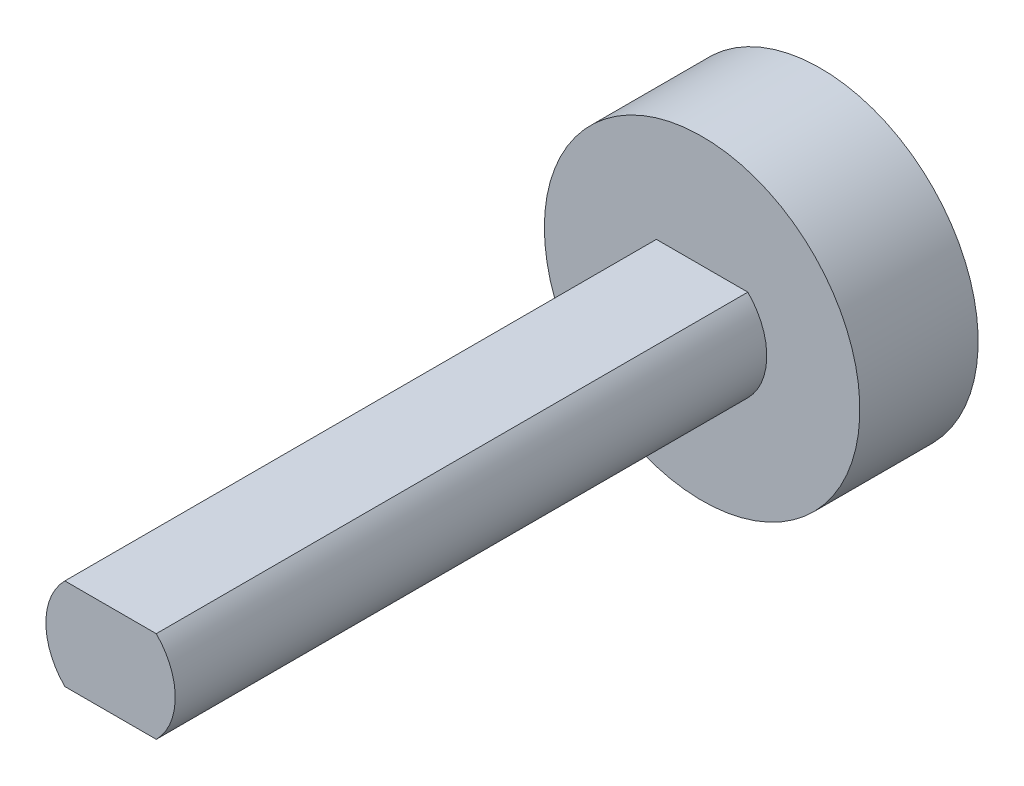
ISO-10303-21;
HEADER;
FILE_DESCRIPTION(('STEP AP214'),'2;1');
FILE_NAME('part.step','',(''),(''),'','','');
FILE_SCHEMA(('AUTOMOTIVE_DESIGN { 1 0 10303 214 1 1 1 1 }'));
ENDSEC;
DATA;
#1=APPLICATION_CONTEXT('core data for automotive mechanical design processes');
#2=APPLICATION_PROTOCOL_DEFINITION('international standard','automotive_design',2000,#1);
#3=PRODUCT_CONTEXT('',#1,'mechanical');
#4=PRODUCT('Part','Part','',(#3));
#5=PRODUCT_RELATED_PRODUCT_CATEGORY('part','',(#4));
#6=PRODUCT_DEFINITION_FORMATION('','',#4);
#7=PRODUCT_DEFINITION_CONTEXT('part definition',#1,'design');
#8=PRODUCT_DEFINITION('design','',#6,#7);
#9=PRODUCT_DEFINITION_SHAPE('','',#8);
#10=(LENGTH_UNIT() NAMED_UNIT(*) SI_UNIT(.MILLI.,.METRE.));
#11=(NAMED_UNIT(*) PLANE_ANGLE_UNIT() SI_UNIT($,.RADIAN.));
#12=(NAMED_UNIT(*) SI_UNIT($,.STERADIAN.) SOLID_ANGLE_UNIT());
#13=UNCERTAINTY_MEASURE_WITH_UNIT(LENGTH_MEASURE(1.E-05),#10,'distance_accuracy_value','');
#14=(GEOMETRIC_REPRESENTATION_CONTEXT(3) GLOBAL_UNCERTAINTY_ASSIGNED_CONTEXT((#13)) GLOBAL_UNIT_ASSIGNED_CONTEXT((#10,
#11,#12)) REPRESENTATION_CONTEXT('',''));
#15=CARTESIAN_POINT('',(0.,0.,0.));
#16=DIRECTION('',(0.,0.,1.));
#17=DIRECTION('',(1.,0.,0.));
#18=AXIS2_PLACEMENT_3D('',#15,#16,#17);
#19=CARTESIAN_POINT('',(0.,0.,114.3));
#20=DIRECTION('',(0.,0.,-1.));
#21=DIRECTION('',(-1.,0.,0.));
#22=AXIS2_PLACEMENT_3D('',#19,#20,#21);
#23=CYLINDRICAL_SURFACE('',#22,10.414);
#24=CARTESIAN_POINT('',(0.,0.,19.05));
#25=DIRECTION('',(0.,0.,-1.));
#26=DIRECTION('',(-1.,0.,0.));
#27=AXIS2_PLACEMENT_3D('',#24,#25,#26);
#28=CIRCLE('',#27,10.414);
#29=CARTESIAN_POINT('',(7.3594523828656,7.36816507852083,19.05));
#30=VERTEX_POINT('',#29);
#31=CARTESIAN_POINT('',(7.3594523828656,-7.36816507852083,19.05));
#32=VERTEX_POINT('',#31);
#33=EDGE_CURVE('E54',#30,#32,#28,.T.);
#34=ORIENTED_EDGE('',*,*,#33,.F.);
#35=DIRECTION('',(0.,0.,-1.));
#36=VECTOR('',#35,1.);
#37=CARTESIAN_POINT('',(7.3594523828656,7.36816507852083,114.3));
#38=LINE('',#37,#36);
#39=CARTESIAN_POINT('',(7.3594523828656,7.36816507852083,114.3));
#40=VERTEX_POINT('',#39);
#41=EDGE_CURVE('E47',#40,#30,#38,.T.);
#42=ORIENTED_EDGE('',*,*,#41,.F.);
#43=CARTESIAN_POINT('',(0.,0.,114.3));
#44=DIRECTION('',(0.,0.,1.));
#45=DIRECTION('',(1.,0.,0.));
#46=AXIS2_PLACEMENT_3D('',#43,#44,#45);
#47=CIRCLE('',#46,10.414);
#48=CARTESIAN_POINT('',(7.3594523828656,-7.36816507852083,114.3));
#49=VERTEX_POINT('',#48);
#50=EDGE_CURVE('E103',#49,#40,#47,.T.);
#51=ORIENTED_EDGE('',*,*,#50,.F.);
#52=DIRECTION('',(0.,0.,-1.));
#53=VECTOR('',#52,1.);
#54=CARTESIAN_POINT('',(7.3594523828656,-7.36816507852083,114.3));
#55=LINE('',#54,#53);
#56=EDGE_CURVE('E92',#49,#32,#55,.T.);
#57=ORIENTED_EDGE('',*,*,#56,.T.);
#58=EDGE_LOOP('',(#34,#42,#51,#57));
#59=FACE_BOUND('',#58,.T.);
#60=ADVANCED_FACE('F39',(#59),#23,.T.);
#61=CARTESIAN_POINT('',(-7.3594523828656,7.36816507852083,114.3));
#62=DIRECTION('',(0.,-1.,0.));
#63=DIRECTION('',(0.,0.,-1.));
#64=AXIS2_PLACEMENT_3D('',#61,#62,#63);
#65=PLANE('',#64);
#66=DIRECTION('',(1.,0.,0.));
#67=VECTOR('',#66,1.);
#68=CARTESIAN_POINT('',(-7.3594523828656,7.36816507852083,19.05));
#69=LINE('',#68,#67);
#70=CARTESIAN_POINT('',(-7.3594523828656,7.36816507852083,19.05));
#71=VERTEX_POINT('',#70);
#72=EDGE_CURVE('E61',#71,#30,#69,.T.);
#73=ORIENTED_EDGE('',*,*,#72,.F.);
#74=DIRECTION('',(0.,0.,-1.));
#75=VECTOR('',#74,1.);
#76=CARTESIAN_POINT('',(-7.3594523828656,7.36816507852083,114.3));
#77=LINE('',#76,#75);
#78=CARTESIAN_POINT('',(-7.3594523828656,7.36816507852083,114.3));
#79=VERTEX_POINT('',#78);
#80=EDGE_CURVE('E91',#79,#71,#77,.T.);
#81=ORIENTED_EDGE('',*,*,#80,.F.);
#82=DIRECTION('',(-1.,0.,0.));
#83=VECTOR('',#82,1.);
#84=CARTESIAN_POINT('',(-7.3594523828656,7.36816507852083,114.3));
#85=LINE('',#84,#83);
#86=EDGE_CURVE('E108',#40,#79,#85,.T.);
#87=ORIENTED_EDGE('',*,*,#86,.F.);
#88=ORIENTED_EDGE('',*,*,#41,.T.);
#89=EDGE_LOOP('',(#73,#81,#87,#88));
#90=FACE_BOUND('',#89,.T.);
#91=ADVANCED_FACE('F123',(#90),#65,.F.);
#92=CARTESIAN_POINT('',(0.,0.,114.3));
#93=DIRECTION('',(0.,0.,-1.));
#94=DIRECTION('',(-1.,0.,0.));
#95=AXIS2_PLACEMENT_3D('',#92,#93,#94);
#96=CYLINDRICAL_SURFACE('',#95,10.414);
#97=CARTESIAN_POINT('',(0.,0.,19.05));
#98=DIRECTION('',(0.,0.,-1.));
#99=DIRECTION('',(-1.,0.,0.));
#100=AXIS2_PLACEMENT_3D('',#97,#98,#99);
#101=CIRCLE('',#100,10.414);
#102=CARTESIAN_POINT('',(-7.3594523828656,-7.36816507852083,19.05));
#103=VERTEX_POINT('',#102);
#104=EDGE_CURVE('E95',#103,#71,#101,.T.);
#105=ORIENTED_EDGE('',*,*,#104,.F.);
#106=DIRECTION('',(0.,0.,-1.));
#107=VECTOR('',#106,1.);
#108=CARTESIAN_POINT('',(-7.3594523828656,-7.36816507852083,114.3));
#109=LINE('',#108,#107);
#110=CARTESIAN_POINT('',(-7.3594523828656,-7.36816507852083,114.3));
#111=VERTEX_POINT('',#110);
#112=EDGE_CURVE('E83',#111,#103,#109,.T.);
#113=ORIENTED_EDGE('',*,*,#112,.F.);
#114=CARTESIAN_POINT('',(0.,0.,114.3));
#115=DIRECTION('',(0.,0.,1.));
#116=DIRECTION('',(1.,0.,0.));
#117=AXIS2_PLACEMENT_3D('',#114,#115,#116);
#118=CIRCLE('',#117,10.414);
#119=EDGE_CURVE('E114',#79,#111,#118,.T.);
#120=ORIENTED_EDGE('',*,*,#119,.F.);
#121=ORIENTED_EDGE('',*,*,#80,.T.);
#122=EDGE_LOOP('',(#105,#113,#120,#121));
#123=FACE_BOUND('',#122,.T.);
#124=ADVANCED_FACE('F96',(#123),#96,.T.);
#125=CARTESIAN_POINT('',(-7.3594523828656,-7.36816507852083,114.3));
#126=DIRECTION('',(0.,1.,0.));
#127=DIRECTION('',(0.,0.,1.));
#128=AXIS2_PLACEMENT_3D('',#125,#126,#127);
#129=PLANE('',#128);
#130=DIRECTION('',(-1.,0.,0.));
#131=VECTOR('',#130,1.);
#132=CARTESIAN_POINT('',(-7.3594523828656,-7.36816507852083,19.05));
#133=LINE('',#132,#131);
#134=EDGE_CURVE('E11',#32,#103,#133,.T.);
#135=ORIENTED_EDGE('',*,*,#134,.F.);
#136=ORIENTED_EDGE('',*,*,#56,.F.);
#137=DIRECTION('',(1.,0.,0.));
#138=VECTOR('',#137,1.);
#139=CARTESIAN_POINT('',(-7.3594523828656,-7.36816507852083,114.3));
#140=LINE('',#139,#138);
#141=EDGE_CURVE('E87',#111,#49,#140,.T.);
#142=ORIENTED_EDGE('',*,*,#141,.F.);
#143=ORIENTED_EDGE('',*,*,#112,.T.);
#144=EDGE_LOOP('',(#135,#136,#142,#143));
#145=FACE_BOUND('',#144,.T.);
#146=ADVANCED_FACE('F85',(#145),#129,.F.);
#147=CARTESIAN_POINT('',(0.,0.,114.3));
#148=DIRECTION('',(0.,0.,1.));
#149=DIRECTION('',(1.,0.,0.));
#150=AXIS2_PLACEMENT_3D('',#147,#148,#149);
#151=PLANE('',#150);
#152=ORIENTED_EDGE('',*,*,#50,.T.);
#153=ORIENTED_EDGE('',*,*,#86,.T.);
#154=ORIENTED_EDGE('',*,*,#119,.T.);
#155=ORIENTED_EDGE('',*,*,#141,.T.);
#156=EDGE_LOOP('',(#152,#153,#154,#155));
#157=FACE_BOUND('',#156,.T.);
#158=ADVANCED_FACE('F126',(#157),#151,.T.);
#159=CARTESIAN_POINT('',(0.,0.,19.05));
#160=DIRECTION('',(0.,0.,-1.));
#161=DIRECTION('',(-1.,0.,0.));
#162=AXIS2_PLACEMENT_3D('',#159,#160,#161);
#163=PLANE('',#162);
#164=CARTESIAN_POINT('',(0.,0.,19.05));
#165=DIRECTION('',(0.,0.,-1.));
#166=DIRECTION('',(-1.,0.,0.));
#167=AXIS2_PLACEMENT_3D('',#164,#165,#166);
#168=CIRCLE('',#167,25.4019693886395);
#169=CARTESIAN_POINT('',(-25.4019693886395,0.,19.05));
#170=VERTEX_POINT('',#169);
#171=EDGE_CURVE('E99',#170,#170,#168,.T.);
#172=ORIENTED_EDGE('',*,*,#171,.F.);
#173=EDGE_LOOP('',(#172));
#174=FACE_BOUND('',#173,.T.);
#175=ORIENTED_EDGE('',*,*,#72,.T.);
#176=ORIENTED_EDGE('',*,*,#33,.T.);
#177=ORIENTED_EDGE('',*,*,#134,.T.);
#178=ORIENTED_EDGE('',*,*,#104,.T.);
#179=EDGE_LOOP('',(#175,#176,#177,#178));
#180=FACE_BOUND('',#179,.T.);
#181=ADVANCED_FACE('F101',(#174,#180),#163,.F.);
#182=CARTESIAN_POINT('',(0.,0.,19.05));
#183=DIRECTION('',(0.,0.,-1.));
#184=DIRECTION('',(-1.,0.,0.));
#185=AXIS2_PLACEMENT_3D('',#182,#183,#184);
#186=CYLINDRICAL_SURFACE('',#185,25.4019693886395);
#187=ORIENTED_EDGE('',*,*,#171,.T.);
#188=EDGE_LOOP('',(#187));
#189=FACE_BOUND('',#188,.T.);
#190=CARTESIAN_POINT('',(0.,0.,0.));
#191=DIRECTION('',(0.,0.,-1.));
#192=DIRECTION('',(-1.,0.,0.));
#193=AXIS2_PLACEMENT_3D('',#190,#191,#192);
#194=CIRCLE('',#193,25.4019693886395);
#195=CARTESIAN_POINT('',(-25.4019693886395,0.,0.));
#196=VERTEX_POINT('',#195);
#197=EDGE_CURVE('E156',#196,#196,#194,.T.);
#198=ORIENTED_EDGE('',*,*,#197,.F.);
#199=EDGE_LOOP('',(#198));
#200=FACE_BOUND('',#199,.T.);
#201=ADVANCED_FACE('F133',(#189,#200),#186,.T.);
#202=CARTESIAN_POINT('',(0.,0.,0.));
#203=DIRECTION('',(0.,0.,1.));
#204=DIRECTION('',(1.,0.,0.));
#205=AXIS2_PLACEMENT_3D('',#202,#203,#204);
#206=PLANE('',#205);
#207=ORIENTED_EDGE('',*,*,#197,.T.);
#208=EDGE_LOOP('',(#207));
#209=FACE_BOUND('',#208,.T.);
#210=ADVANCED_FACE('F147',(#209),#206,.F.);
#211=CLOSED_SHELL('',(#60,#91,#124,#146,#158,#181,#201,#210));
#212=MANIFOLD_SOLID_BREP('B2',#211);
#213=ADVANCED_BREP_SHAPE_REPRESENTATION('',(#18,#212),#14);
#214=SHAPE_DEFINITION_REPRESENTATION(#9,#213);
ENDSEC;
END-ISO-10303-21;
